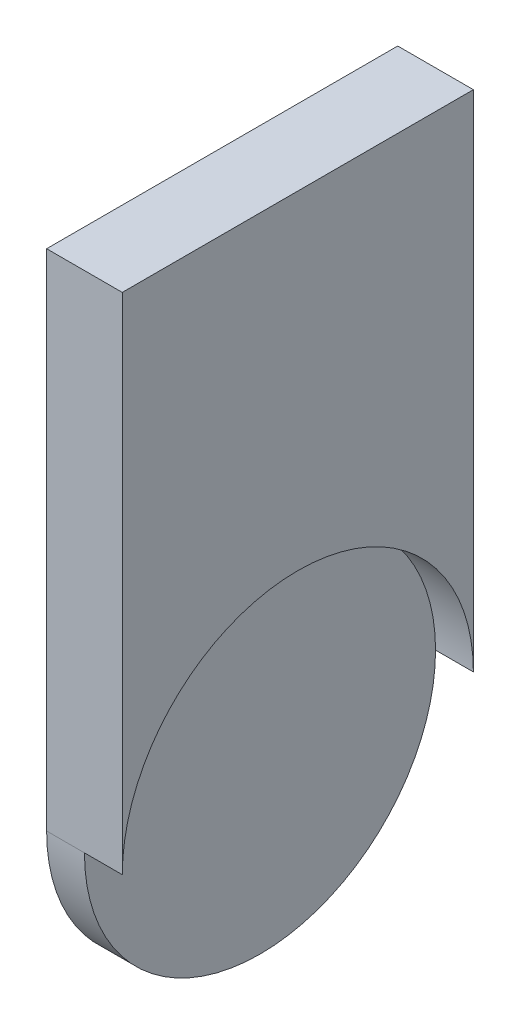
ISO-10303-21;
HEADER;
FILE_DESCRIPTION(('STEP AP214'),'2;1');
FILE_NAME('part.step','',(''),(''),'','','');
FILE_SCHEMA(('AUTOMOTIVE_DESIGN { 1 0 10303 214 1 1 1 1 }'));
ENDSEC;
DATA;
#1=APPLICATION_CONTEXT('core data for automotive mechanical design processes');
#2=APPLICATION_PROTOCOL_DEFINITION('international standard','automotive_design',2000,#1);
#3=PRODUCT_CONTEXT('',#1,'mechanical');
#4=PRODUCT('Part','Part','',(#3));
#5=PRODUCT_RELATED_PRODUCT_CATEGORY('part','',(#4));
#6=PRODUCT_DEFINITION_FORMATION('','',#4);
#7=PRODUCT_DEFINITION_CONTEXT('part definition',#1,'design');
#8=PRODUCT_DEFINITION('design','',#6,#7);
#9=PRODUCT_DEFINITION_SHAPE('','',#8);
#10=(LENGTH_UNIT() NAMED_UNIT(*) SI_UNIT(.MILLI.,.METRE.));
#11=(NAMED_UNIT(*) PLANE_ANGLE_UNIT() SI_UNIT($,.RADIAN.));
#12=(NAMED_UNIT(*) SI_UNIT($,.STERADIAN.) SOLID_ANGLE_UNIT());
#13=UNCERTAINTY_MEASURE_WITH_UNIT(LENGTH_MEASURE(1.E-05),#10,'distance_accuracy_value','');
#14=(GEOMETRIC_REPRESENTATION_CONTEXT(3) GLOBAL_UNCERTAINTY_ASSIGNED_CONTEXT((#13)) GLOBAL_UNIT_ASSIGNED_CONTEXT((#10,
#11,#12)) REPRESENTATION_CONTEXT('',''));
#15=CARTESIAN_POINT('',(0.,0.,0.));
#16=DIRECTION('',(0.,0.,1.));
#17=DIRECTION('',(1.,0.,0.));
#18=AXIS2_PLACEMENT_3D('',#15,#16,#17);
#19=CARTESIAN_POINT('',(6.,-1.10603448275862,1.44051724137931));
#20=DIRECTION('',(-1.,0.,0.));
#21=DIRECTION('',(0.,0.,1.));
#22=AXIS2_PLACEMENT_3D('',#19,#20,#21);
#23=CYLINDRICAL_SURFACE('',#22,13.925);
#24=DIRECTION('',(-1.,0.,0.));
#25=VECTOR('',#24,1.);
#26=CARTESIAN_POINT('',(6.,-1.10603448275862,-12.4844827586207));
#27=LINE('',#26,#25);
#28=CARTESIAN_POINT('',(3.,-1.10603448275862,-12.4844827586207));
#29=VERTEX_POINT('',#28);
#30=CARTESIAN_POINT('',(0.,-1.10603448275862,-12.4844827586207));
#31=VERTEX_POINT('',#30);
#32=EDGE_CURVE('E76',#29,#31,#27,.T.);
#33=ORIENTED_EDGE('',*,*,#32,.F.);
#34=CARTESIAN_POINT('',(3.,-1.10603448275862,1.44051724137931));
#35=DIRECTION('',(1.,0.,0.));
#36=DIRECTION('',(0.,0.,-1.));
#37=AXIS2_PLACEMENT_3D('',#34,#35,#36);
#38=CIRCLE('',#37,13.925);
#39=CARTESIAN_POINT('',(3.,-1.10603448275862,15.3655172413793));
#40=VERTEX_POINT('',#39);
#41=EDGE_CURVE('E90',#40,#29,#38,.T.);
#42=ORIENTED_EDGE('',*,*,#41,.F.);
#43=DIRECTION('',(-1.,0.,0.));
#44=VECTOR('',#43,1.);
#45=CARTESIAN_POINT('',(6.,-1.10603448275862,15.3655172413793));
#46=LINE('',#45,#44);
#47=CARTESIAN_POINT('',(0.,-1.10603448275862,15.3655172413793));
#48=VERTEX_POINT('',#47);
#49=EDGE_CURVE('E70',#40,#48,#46,.T.);
#50=ORIENTED_EDGE('',*,*,#49,.T.);
#51=CARTESIAN_POINT('',(0.,-1.10603448275862,1.44051724137931));
#52=DIRECTION('',(1.,0.,0.));
#53=DIRECTION('',(0.,0.,-1.));
#54=AXIS2_PLACEMENT_3D('',#51,#52,#53);
#55=CIRCLE('',#54,13.925);
#56=EDGE_CURVE('E100',#31,#48,#55,.F.);
#57=ORIENTED_EDGE('',*,*,#56,.F.);
#58=EDGE_LOOP('',(#33,#42,#50,#57));
#59=FACE_BOUND('',#58,.T.);
#60=ADVANCED_FACE('F35',(#59),#23,.T.);
#61=CARTESIAN_POINT('',(6.,0.,-12.4844827586207));
#62=DIRECTION('',(0.,0.,-1.));
#63=DIRECTION('',(0.,1.,0.));
#64=AXIS2_PLACEMENT_3D('',#61,#62,#63);
#65=PLANE('',#64);
#66=DIRECTION('',(0.,-1.,0.));
#67=VECTOR('',#66,1.);
#68=CARTESIAN_POINT('',(0.,0.,-12.4844827586207));
#69=LINE('',#68,#67);
#70=CARTESIAN_POINT('',(0.,38.8939655172414,-12.4844827586207));
#71=VERTEX_POINT('',#70);
#72=EDGE_CURVE('E98',#71,#31,#69,.T.);
#73=ORIENTED_EDGE('',*,*,#72,.F.);
#74=DIRECTION('',(-1.,0.,0.));
#75=VECTOR('',#74,1.);
#76=CARTESIAN_POINT('',(6.,38.8939655172414,-12.4844827586207));
#77=LINE('',#76,#75);
#78=CARTESIAN_POINT('',(6.,38.8939655172414,-12.4844827586207));
#79=VERTEX_POINT('',#78);
#80=EDGE_CURVE('E11',#79,#71,#77,.T.);
#81=ORIENTED_EDGE('',*,*,#80,.F.);
#82=DIRECTION('',(0.,-1.,0.));
#83=VECTOR('',#82,1.);
#84=CARTESIAN_POINT('',(6.,0.,-12.4844827586207));
#85=LINE('',#84,#83);
#86=CARTESIAN_POINT('',(6.,-1.10603448275862,-12.4844827586207));
#87=VERTEX_POINT('',#86);
#88=EDGE_CURVE('E103',#79,#87,#85,.T.);
#89=ORIENTED_EDGE('',*,*,#88,.T.);
#90=EDGE_CURVE('E52',#87,#29,#27,.T.);
#91=ORIENTED_EDGE('',*,*,#90,.T.);
#92=ORIENTED_EDGE('',*,*,#32,.T.);
#93=EDGE_LOOP('',(#73,#81,#89,#91,#92));
#94=FACE_BOUND('',#93,.T.);
#95=ADVANCED_FACE('F37',(#94),#65,.T.);
#96=CARTESIAN_POINT('',(6.,38.8939655172414,0.));
#97=DIRECTION('',(0.,1.,0.));
#98=DIRECTION('',(0.,0.,1.));
#99=AXIS2_PLACEMENT_3D('',#96,#97,#98);
#100=PLANE('',#99);
#101=DIRECTION('',(0.,0.,-1.));
#102=VECTOR('',#101,1.);
#103=CARTESIAN_POINT('',(0.,38.8939655172414,0.));
#104=LINE('',#103,#102);
#105=CARTESIAN_POINT('',(0.,38.8939655172414,15.3655172413793));
#106=VERTEX_POINT('',#105);
#107=EDGE_CURVE('E120',#106,#71,#104,.T.);
#108=ORIENTED_EDGE('',*,*,#107,.F.);
#109=DIRECTION('',(-1.,0.,0.));
#110=VECTOR('',#109,1.);
#111=CARTESIAN_POINT('',(6.,38.8939655172414,15.3655172413793));
#112=LINE('',#111,#110);
#113=CARTESIAN_POINT('',(6.,38.8939655172414,15.3655172413793));
#114=VERTEX_POINT('',#113);
#115=EDGE_CURVE('E44',#114,#106,#112,.T.);
#116=ORIENTED_EDGE('',*,*,#115,.F.);
#117=DIRECTION('',(0.,0.,-1.));
#118=VECTOR('',#117,1.);
#119=CARTESIAN_POINT('',(6.,38.8939655172414,0.));
#120=LINE('',#119,#118);
#121=EDGE_CURVE('E126',#114,#79,#120,.T.);
#122=ORIENTED_EDGE('',*,*,#121,.T.);
#123=ORIENTED_EDGE('',*,*,#80,.T.);
#124=EDGE_LOOP('',(#108,#116,#122,#123));
#125=FACE_BOUND('',#124,.T.);
#126=ADVANCED_FACE('F121',(#125),#100,.T.);
#127=CARTESIAN_POINT('',(6.,0.,15.3655172413793));
#128=DIRECTION('',(0.,0.,-1.));
#129=DIRECTION('',(0.,1.,0.));
#130=AXIS2_PLACEMENT_3D('',#127,#128,#129);
#131=PLANE('',#130);
#132=DIRECTION('',(0.,-1.,0.));
#133=VECTOR('',#132,1.);
#134=CARTESIAN_POINT('',(0.,0.,15.3655172413793));
#135=LINE('',#134,#133);
#136=EDGE_CURVE('E111',#106,#48,#135,.T.);
#137=ORIENTED_EDGE('',*,*,#136,.T.);
#138=ORIENTED_EDGE('',*,*,#49,.F.);
#139=CARTESIAN_POINT('',(6.,-1.10603448275862,15.3655172413793));
#140=VERTEX_POINT('',#139);
#141=EDGE_CURVE('E97',#140,#40,#46,.T.);
#142=ORIENTED_EDGE('',*,*,#141,.F.);
#143=DIRECTION('',(0.,-1.,0.));
#144=VECTOR('',#143,1.);
#145=CARTESIAN_POINT('',(6.,0.,15.3655172413793));
#146=LINE('',#145,#144);
#147=EDGE_CURVE('E101',#114,#140,#146,.T.);
#148=ORIENTED_EDGE('',*,*,#147,.F.);
#149=ORIENTED_EDGE('',*,*,#115,.T.);
#150=EDGE_LOOP('',(#137,#138,#142,#148,#149));
#151=FACE_BOUND('',#150,.T.);
#152=ADVANCED_FACE('F110',(#151),#131,.F.);
#153=CARTESIAN_POINT('',(6.,0.,0.));
#154=DIRECTION('',(1.,0.,0.));
#155=DIRECTION('',(0.,0.,-1.));
#156=AXIS2_PLACEMENT_3D('',#153,#154,#155);
#157=PLANE('',#156);
#158=CARTESIAN_POINT('',(6.,-1.10603448275862,1.44051724137931));
#159=DIRECTION('',(1.,0.,0.));
#160=DIRECTION('',(0.,0.,-1.));
#161=AXIS2_PLACEMENT_3D('',#158,#159,#160);
#162=CIRCLE('',#161,13.925);
#163=EDGE_CURVE('E93',#87,#140,#162,.T.);
#164=ORIENTED_EDGE('',*,*,#163,.F.);
#165=ORIENTED_EDGE('',*,*,#88,.F.);
#166=ORIENTED_EDGE('',*,*,#121,.F.);
#167=ORIENTED_EDGE('',*,*,#147,.T.);
#168=EDGE_LOOP('',(#164,#165,#166,#167));
#169=FACE_BOUND('',#168,.T.);
#170=ADVANCED_FACE('F130',(#169),#157,.T.);
#171=CARTESIAN_POINT('',(0.,0.,0.));
#172=DIRECTION('',(1.,0.,0.));
#173=DIRECTION('',(0.,0.,-1.));
#174=AXIS2_PLACEMENT_3D('',#171,#172,#173);
#175=PLANE('',#174);
#176=ORIENTED_EDGE('',*,*,#72,.T.);
#177=ORIENTED_EDGE('',*,*,#56,.T.);
#178=ORIENTED_EDGE('',*,*,#136,.F.);
#179=ORIENTED_EDGE('',*,*,#107,.T.);
#180=EDGE_LOOP('',(#176,#177,#178,#179));
#181=FACE_BOUND('',#180,.T.);
#182=ADVANCED_FACE('F119',(#181),#175,.F.);
#183=CARTESIAN_POINT('',(3.,-1.10603448275862,1.44051724137931));
#184=DIRECTION('',(1.,0.,0.));
#185=DIRECTION('',(0.,0.,-1.));
#186=AXIS2_PLACEMENT_3D('',#183,#184,#185);
#187=CYLINDRICAL_SURFACE('',#186,13.925);
#188=ORIENTED_EDGE('',*,*,#90,.F.);
#189=ORIENTED_EDGE('',*,*,#163,.T.);
#190=ORIENTED_EDGE('',*,*,#141,.T.);
#191=EDGE_CURVE('E92',#29,#40,#38,.T.);
#192=ORIENTED_EDGE('',*,*,#191,.F.);
#193=EDGE_LOOP('',(#188,#189,#190,#192));
#194=FACE_BOUND('',#193,.T.);
#195=ADVANCED_FACE('F95',(#194),#187,.F.);
#196=CARTESIAN_POINT('',(3.,-1.10603448275862,1.44051724137931));
#197=DIRECTION('',(1.,0.,0.));
#198=DIRECTION('',(0.,0.,-1.));
#199=AXIS2_PLACEMENT_3D('',#196,#197,#198);
#200=PLANE('',#199);
#201=ORIENTED_EDGE('',*,*,#191,.T.);
#202=ORIENTED_EDGE('',*,*,#41,.T.);
#203=EDGE_LOOP('',(#201,#202));
#204=FACE_BOUND('',#203,.T.);
#205=ADVANCED_FACE('F91',(#204),#200,.T.);
#206=CLOSED_SHELL('',(#60,#95,#126,#152,#170,#182,#195,#205));
#207=MANIFOLD_SOLID_BREP('B2',#206);
#208=ADVANCED_BREP_SHAPE_REPRESENTATION('',(#18,#207),#14);
#209=SHAPE_DEFINITION_REPRESENTATION(#9,#208);
ENDSEC;
END-ISO-10303-21;
